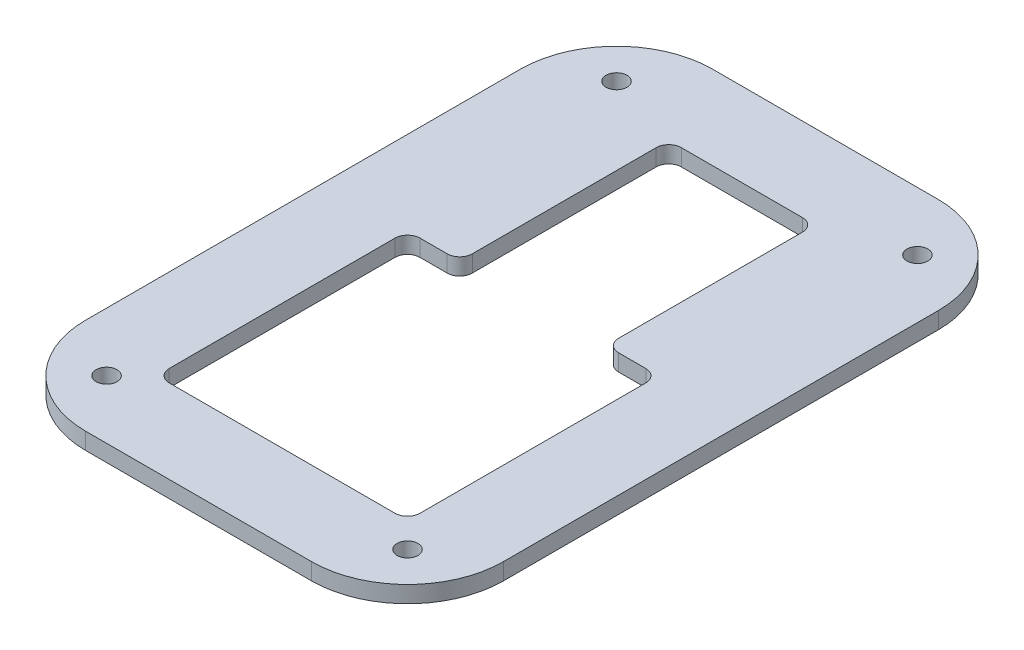
ISO-10303-21;
HEADER;
FILE_DESCRIPTION(('STEP AP214'),'2;1');
FILE_NAME('part.step','',(''),(''),'','','');
FILE_SCHEMA(('AUTOMOTIVE_DESIGN { 1 0 10303 214 1 1 1 1 }'));
ENDSEC;
DATA;
#1=APPLICATION_CONTEXT('core data for automotive mechanical design processes');
#2=APPLICATION_PROTOCOL_DEFINITION('international standard','automotive_design',2000,#1);
#3=PRODUCT_CONTEXT('',#1,'mechanical');
#4=PRODUCT('Part','Part','',(#3));
#5=PRODUCT_RELATED_PRODUCT_CATEGORY('part','',(#4));
#6=PRODUCT_DEFINITION_FORMATION('','',#4);
#7=PRODUCT_DEFINITION_CONTEXT('part definition',#1,'design');
#8=PRODUCT_DEFINITION('design','',#6,#7);
#9=PRODUCT_DEFINITION_SHAPE('','',#8);
#10=(LENGTH_UNIT() NAMED_UNIT(*) SI_UNIT(.MILLI.,.METRE.));
#11=(NAMED_UNIT(*) PLANE_ANGLE_UNIT() SI_UNIT($,.RADIAN.));
#12=(NAMED_UNIT(*) SI_UNIT($,.STERADIAN.) SOLID_ANGLE_UNIT());
#13=UNCERTAINTY_MEASURE_WITH_UNIT(LENGTH_MEASURE(1.E-05),#10,'distance_accuracy_value','');
#14=(GEOMETRIC_REPRESENTATION_CONTEXT(3) GLOBAL_UNCERTAINTY_ASSIGNED_CONTEXT((#13)) GLOBAL_UNIT_ASSIGNED_CONTEXT((#10,
#11,#12)) REPRESENTATION_CONTEXT('',''));
#15=CARTESIAN_POINT('',(0.,0.,0.));
#16=DIRECTION('',(0.,0.,1.));
#17=DIRECTION('',(1.,0.,0.));
#18=AXIS2_PLACEMENT_3D('',#15,#16,#17);
#19=CARTESIAN_POINT('',(-27.,4.,27.));
#20=DIRECTION('',(0.,-1.,0.));
#21=DIRECTION('',(0.,0.,-1.));
#22=AXIS2_PLACEMENT_3D('',#19,#20,#21);
#23=PLANE('',#22);
#24=CARTESIAN_POINT('',(-27.,4.,27.));
#25=DIRECTION('',(0.,1.,0.));
#26=DIRECTION('',(0.,0.,-1.));
#27=AXIS2_PLACEMENT_3D('',#24,#25,#26);
#28=CIRCLE('',#27,23.);
#29=CARTESIAN_POINT('',(-50.,4.,27.));
#30=VERTEX_POINT('',#29);
#31=CARTESIAN_POINT('',(-26.9999999999998,4.,50.));
#32=VERTEX_POINT('',#31);
#33=EDGE_CURVE('E318',#30,#32,#28,.T.);
#34=ORIENTED_EDGE('',*,*,#33,.T.);
#35=DIRECTION('',(1.,0.,0.));
#36=VECTOR('',#35,1.);
#37=CARTESIAN_POINT('',(-26.9999999999998,4.,50.));
#38=LINE('',#37,#36);
#39=CARTESIAN_POINT('',(27.,4.,50.));
#40=VERTEX_POINT('',#39);
#41=EDGE_CURVE('E321',#32,#40,#38,.T.);
#42=ORIENTED_EDGE('',*,*,#41,.T.);
#43=CARTESIAN_POINT('',(27.,4.,27.));
#44=DIRECTION('',(0.,1.,0.));
#45=DIRECTION('',(0.,0.,1.));
#46=AXIS2_PLACEMENT_3D('',#43,#44,#45);
#47=CIRCLE('',#46,23.);
#48=CARTESIAN_POINT('',(50.,4.,26.9999999999998));
#49=VERTEX_POINT('',#48);
#50=EDGE_CURVE('E324',#40,#49,#47,.T.);
#51=ORIENTED_EDGE('',*,*,#50,.T.);
#52=DIRECTION('',(0.,0.,-1.));
#53=VECTOR('',#52,1.);
#54=CARTESIAN_POINT('',(50.,4.,26.9999999999998));
#55=LINE('',#54,#53);
#56=CARTESIAN_POINT('',(50.,4.,-77.));
#57=VERTEX_POINT('',#56);
#58=EDGE_CURVE('E326',#49,#57,#55,.T.);
#59=ORIENTED_EDGE('',*,*,#58,.T.);
#60=CARTESIAN_POINT('',(27.,4.,-77.));
#61=DIRECTION('',(0.,1.,0.));
#62=DIRECTION('',(0.,0.,1.));
#63=AXIS2_PLACEMENT_3D('',#60,#61,#62);
#64=CIRCLE('',#63,23.);
#65=CARTESIAN_POINT('',(27.,4.,-100.));
#66=VERTEX_POINT('',#65);
#67=EDGE_CURVE('E328',#57,#66,#64,.T.);
#68=ORIENTED_EDGE('',*,*,#67,.T.);
#69=DIRECTION('',(-1.,0.,0.));
#70=VECTOR('',#69,1.);
#71=CARTESIAN_POINT('',(-27.,4.,-100.));
#72=LINE('',#71,#70);
#73=CARTESIAN_POINT('',(-27.,4.,-100.));
#74=VERTEX_POINT('',#73);
#75=EDGE_CURVE('E330',#66,#74,#72,.T.);
#76=ORIENTED_EDGE('',*,*,#75,.T.);
#77=CARTESIAN_POINT('',(-27.,4.,-77.));
#78=DIRECTION('',(0.,1.,0.));
#79=DIRECTION('',(0.,0.,-1.));
#80=AXIS2_PLACEMENT_3D('',#77,#78,#79);
#81=CIRCLE('',#80,23.);
#82=CARTESIAN_POINT('',(-50.,4.,-77.));
#83=VERTEX_POINT('',#82);
#84=EDGE_CURVE('E332',#74,#83,#81,.T.);
#85=ORIENTED_EDGE('',*,*,#84,.T.);
#86=DIRECTION('',(0.,0.,1.));
#87=VECTOR('',#86,1.);
#88=CARTESIAN_POINT('',(-50.,4.,27.));
#89=LINE('',#88,#87);
#90=EDGE_CURVE('E334',#83,#30,#89,.T.);
#91=ORIENTED_EDGE('',*,*,#90,.T.);
#92=EDGE_LOOP('',(#34,#42,#51,#59,#68,#76,#85,#91));
#93=FACE_BOUND('',#92,.T.);
#94=CARTESIAN_POINT('',(-27.,4.,27.));
#95=DIRECTION('',(0.,1.,0.));
#96=DIRECTION('',(0.,0.,-1.));
#97=AXIS2_PLACEMENT_3D('',#94,#95,#96);
#98=CIRCLE('',#97,3.);
#99=CARTESIAN_POINT('',(-30.,4.,27.));
#100=VERTEX_POINT('',#99);
#101=CARTESIAN_POINT('',(-27.,4.,30.));
#102=VERTEX_POINT('',#101);
#103=EDGE_CURVE('E194',#100,#102,#98,.T.);
#104=ORIENTED_EDGE('',*,*,#103,.F.);
#105=DIRECTION('',(0.,0.,1.));
#106=VECTOR('',#105,1.);
#107=CARTESIAN_POINT('',(-30.,4.,27.));
#108=LINE('',#107,#106);
#109=CARTESIAN_POINT('',(-30.,4.,-27.));
#110=VERTEX_POINT('',#109);
#111=EDGE_CURVE('E245',#110,#100,#108,.T.);
#112=ORIENTED_EDGE('',*,*,#111,.F.);
#113=CARTESIAN_POINT('',(-27.,4.,-27.));
#114=DIRECTION('',(0.,1.,0.));
#115=DIRECTION('',(0.,0.,-1.));
#116=AXIS2_PLACEMENT_3D('',#113,#114,#115);
#117=CIRCLE('',#116,3.);
#118=CARTESIAN_POINT('',(-27.,4.,-30.));
#119=VERTEX_POINT('',#118);
#120=EDGE_CURVE('E243',#119,#110,#117,.T.);
#121=ORIENTED_EDGE('',*,*,#120,.F.);
#122=DIRECTION('',(-1.,0.,0.));
#123=VECTOR('',#122,1.);
#124=CARTESIAN_POINT('',(-27.,4.,-30.));
#125=LINE('',#124,#123);
#126=CARTESIAN_POINT('',(-20.5,4.,-30.));
#127=VERTEX_POINT('',#126);
#128=EDGE_CURVE('E241',#127,#119,#125,.T.);
#129=ORIENTED_EDGE('',*,*,#128,.F.);
#130=CARTESIAN_POINT('',(-20.5,4.,-33.));
#131=DIRECTION('',(0.,-1.,0.));
#132=DIRECTION('',(0.,0.,-1.));
#133=AXIS2_PLACEMENT_3D('',#130,#131,#132);
#134=CIRCLE('',#133,3.);
#135=CARTESIAN_POINT('',(-17.5,4.,-33.));
#136=VERTEX_POINT('',#135);
#137=EDGE_CURVE('E239',#136,#127,#134,.T.);
#138=ORIENTED_EDGE('',*,*,#137,.F.);
#139=DIRECTION('',(0.,0.,1.));
#140=VECTOR('',#139,1.);
#141=CARTESIAN_POINT('',(-17.5,4.,-33.));
#142=LINE('',#141,#140);
#143=CARTESIAN_POINT('',(-17.5,4.,-77.));
#144=VERTEX_POINT('',#143);
#145=EDGE_CURVE('E237',#144,#136,#142,.T.);
#146=ORIENTED_EDGE('',*,*,#145,.F.);
#147=CARTESIAN_POINT('',(-14.5,4.,-77.));
#148=DIRECTION('',(0.,1.,0.));
#149=DIRECTION('',(0.,0.,-1.));
#150=AXIS2_PLACEMENT_3D('',#147,#148,#149);
#151=CIRCLE('',#150,3.);
#152=CARTESIAN_POINT('',(-14.5,4.,-80.));
#153=VERTEX_POINT('',#152);
#154=EDGE_CURVE('E235',#153,#144,#151,.T.);
#155=ORIENTED_EDGE('',*,*,#154,.F.);
#156=DIRECTION('',(-1.,0.,0.));
#157=VECTOR('',#156,1.);
#158=CARTESIAN_POINT('',(-14.5,4.,-80.));
#159=LINE('',#158,#157);
#160=CARTESIAN_POINT('',(14.5,4.,-80.));
#161=VERTEX_POINT('',#160);
#162=EDGE_CURVE('E233',#161,#153,#159,.T.);
#163=ORIENTED_EDGE('',*,*,#162,.F.);
#164=CARTESIAN_POINT('',(14.5,4.,-77.));
#165=DIRECTION('',(0.,1.,0.));
#166=DIRECTION('',(0.,0.,-1.));
#167=AXIS2_PLACEMENT_3D('',#164,#165,#166);
#168=CIRCLE('',#167,3.);
#169=CARTESIAN_POINT('',(17.5,4.,-77.));
#170=VERTEX_POINT('',#169);
#171=EDGE_CURVE('E231',#170,#161,#168,.T.);
#172=ORIENTED_EDGE('',*,*,#171,.F.);
#173=DIRECTION('',(0.,0.,-1.));
#174=VECTOR('',#173,1.);
#175=CARTESIAN_POINT('',(17.5,4.,-77.));
#176=LINE('',#175,#174);
#177=CARTESIAN_POINT('',(17.5,4.,-33.));
#178=VERTEX_POINT('',#177);
#179=EDGE_CURVE('E229',#178,#170,#176,.T.);
#180=ORIENTED_EDGE('',*,*,#179,.F.);
#181=CARTESIAN_POINT('',(20.5,4.,-33.));
#182=DIRECTION('',(0.,-1.,0.));
#183=DIRECTION('',(0.,0.,1.));
#184=AXIS2_PLACEMENT_3D('',#181,#182,#183);
#185=CIRCLE('',#184,3.);
#186=CARTESIAN_POINT('',(20.5,4.,-30.));
#187=VERTEX_POINT('',#186);
#188=EDGE_CURVE('E227',#187,#178,#185,.T.);
#189=ORIENTED_EDGE('',*,*,#188,.F.);
#190=DIRECTION('',(-1.,0.,0.));
#191=VECTOR('',#190,1.);
#192=CARTESIAN_POINT('',(20.5,4.,-30.));
#193=LINE('',#192,#191);
#194=CARTESIAN_POINT('',(27.,4.,-30.));
#195=VERTEX_POINT('',#194);
#196=EDGE_CURVE('E225',#195,#187,#193,.T.);
#197=ORIENTED_EDGE('',*,*,#196,.F.);
#198=CARTESIAN_POINT('',(27.,4.,-27.));
#199=DIRECTION('',(0.,1.,0.));
#200=DIRECTION('',(0.,0.,-1.));
#201=AXIS2_PLACEMENT_3D('',#198,#199,#200);
#202=CIRCLE('',#201,3.);
#203=CARTESIAN_POINT('',(30.,4.,-27.));
#204=VERTEX_POINT('',#203);
#205=EDGE_CURVE('E223',#204,#195,#202,.T.);
#206=ORIENTED_EDGE('',*,*,#205,.F.);
#207=DIRECTION('',(0.,0.,-1.));
#208=VECTOR('',#207,1.);
#209=CARTESIAN_POINT('',(30.,4.,27.));
#210=LINE('',#209,#208);
#211=CARTESIAN_POINT('',(30.,4.,27.));
#212=VERTEX_POINT('',#211);
#213=EDGE_CURVE('E218',#212,#204,#210,.T.);
#214=ORIENTED_EDGE('',*,*,#213,.F.);
#215=CARTESIAN_POINT('',(27.,4.,27.));
#216=DIRECTION('',(0.,1.,0.));
#217=DIRECTION('',(0.,0.,1.));
#218=AXIS2_PLACEMENT_3D('',#215,#216,#217);
#219=CIRCLE('',#218,3.);
#220=CARTESIAN_POINT('',(27.,4.,30.));
#221=VERTEX_POINT('',#220);
#222=EDGE_CURVE('E216',#221,#212,#219,.T.);
#223=ORIENTED_EDGE('',*,*,#222,.F.);
#224=DIRECTION('',(1.,0.,0.));
#225=VECTOR('',#224,1.);
#226=CARTESIAN_POINT('',(-27.,4.,30.));
#227=LINE('',#226,#225);
#228=EDGE_CURVE('E202',#102,#221,#227,.T.);
#229=ORIENTED_EDGE('',*,*,#228,.F.);
#230=EDGE_LOOP('',(#104,#112,#121,#129,#138,#146,#155,#163,#172,#180,#189,#197,#206,#214,#223,#229));
#231=FACE_BOUND('',#230,.T.);
#232=CARTESIAN_POINT('',(-36.,4.,36.));
#233=DIRECTION('',(0.,1.,0.));
#234=DIRECTION('',(0.,0.,1.));
#235=AXIS2_PLACEMENT_3D('',#232,#233,#234);
#236=CIRCLE('',#235,2.5);
#237=CARTESIAN_POINT('',(-36.,4.,38.5));
#238=VERTEX_POINT('',#237);
#239=EDGE_CURVE('E248',#238,#238,#236,.T.);
#240=ORIENTED_EDGE('',*,*,#239,.F.);
#241=EDGE_LOOP('',(#240));
#242=FACE_BOUND('',#241,.T.);
#243=CARTESIAN_POINT('',(-36.,4.,-86.));
#244=DIRECTION('',(0.,1.,0.));
#245=DIRECTION('',(0.,0.,1.));
#246=AXIS2_PLACEMENT_3D('',#243,#244,#245);
#247=CIRCLE('',#246,2.5);
#248=CARTESIAN_POINT('',(-36.,4.,-83.5));
#249=VERTEX_POINT('',#248);
#250=EDGE_CURVE('E528',#249,#249,#247,.T.);
#251=ORIENTED_EDGE('',*,*,#250,.F.);
#252=EDGE_LOOP('',(#251));
#253=FACE_BOUND('',#252,.T.);
#254=CARTESIAN_POINT('',(36.,4.,36.));
#255=DIRECTION('',(0.,1.,0.));
#256=DIRECTION('',(0.,0.,-1.));
#257=AXIS2_PLACEMENT_3D('',#254,#255,#256);
#258=CIRCLE('',#257,2.5);
#259=CARTESIAN_POINT('',(36.,4.,33.5));
#260=VERTEX_POINT('',#259);
#261=EDGE_CURVE('E522',#260,#260,#258,.T.);
#262=ORIENTED_EDGE('',*,*,#261,.F.);
#263=EDGE_LOOP('',(#262));
#264=FACE_BOUND('',#263,.T.);
#265=CARTESIAN_POINT('',(36.,4.,-86.));
#266=DIRECTION('',(0.,1.,0.));
#267=DIRECTION('',(0.,0.,-1.));
#268=AXIS2_PLACEMENT_3D('',#265,#266,#267);
#269=CIRCLE('',#268,2.5);
#270=CARTESIAN_POINT('',(36.,4.,-88.5));
#271=VERTEX_POINT('',#270);
#272=EDGE_CURVE('E513',#271,#271,#269,.T.);
#273=ORIENTED_EDGE('',*,*,#272,.F.);
#274=EDGE_LOOP('',(#273));
#275=FACE_BOUND('',#274,.T.);
#276=ADVANCED_FACE('F33',(#93,#231,#242,#253,#264,#275),#23,.F.);
#277=CARTESIAN_POINT('',(-27.,0.,27.));
#278=DIRECTION('',(0.,-1.,0.));
#279=DIRECTION('',(0.,0.,-1.));
#280=AXIS2_PLACEMENT_3D('',#277,#278,#279);
#281=PLANE('',#280);
#282=CARTESIAN_POINT('',(36.,0.,36.));
#283=DIRECTION('',(0.,1.,0.));
#284=DIRECTION('',(0.,0.,-1.));
#285=AXIS2_PLACEMENT_3D('',#282,#283,#284);
#286=CIRCLE('',#285,2.5);
#287=CARTESIAN_POINT('',(36.,0.,33.5));
#288=VERTEX_POINT('',#287);
#289=EDGE_CURVE('E519',#288,#288,#286,.T.);
#290=ORIENTED_EDGE('',*,*,#289,.T.);
#291=EDGE_LOOP('',(#290));
#292=FACE_BOUND('',#291,.T.);
#293=CARTESIAN_POINT('',(-36.,0.,36.));
#294=DIRECTION('',(0.,1.,0.));
#295=DIRECTION('',(0.,0.,1.));
#296=AXIS2_PLACEMENT_3D('',#293,#294,#295);
#297=CIRCLE('',#296,2.5);
#298=CARTESIAN_POINT('',(-36.,0.,38.5));
#299=VERTEX_POINT('',#298);
#300=EDGE_CURVE('E531',#299,#299,#297,.T.);
#301=ORIENTED_EDGE('',*,*,#300,.T.);
#302=EDGE_LOOP('',(#301));
#303=FACE_BOUND('',#302,.T.);
#304=CARTESIAN_POINT('',(-27.,0.,27.));
#305=DIRECTION('',(0.,1.,0.));
#306=DIRECTION('',(0.,0.,-1.));
#307=AXIS2_PLACEMENT_3D('',#304,#305,#306);
#308=CIRCLE('',#307,23.);
#309=CARTESIAN_POINT('',(-50.,0.,27.));
#310=VERTEX_POINT('',#309);
#311=CARTESIAN_POINT('',(-26.9999999999998,0.,50.));
#312=VERTEX_POINT('',#311);
#313=EDGE_CURVE('E210',#310,#312,#308,.T.);
#314=ORIENTED_EDGE('',*,*,#313,.F.);
#315=DIRECTION('',(0.,0.,1.));
#316=VECTOR('',#315,1.);
#317=CARTESIAN_POINT('',(-50.,0.,27.));
#318=LINE('',#317,#316);
#319=CARTESIAN_POINT('',(-50.,0.,-77.));
#320=VERTEX_POINT('',#319);
#321=EDGE_CURVE('E322',#320,#310,#318,.T.);
#322=ORIENTED_EDGE('',*,*,#321,.F.);
#323=CARTESIAN_POINT('',(-27.,0.,-77.));
#324=DIRECTION('',(0.,1.,0.));
#325=DIRECTION('',(0.,0.,-1.));
#326=AXIS2_PLACEMENT_3D('',#323,#324,#325);
#327=CIRCLE('',#326,23.);
#328=CARTESIAN_POINT('',(-27.,0.,-100.));
#329=VERTEX_POINT('',#328);
#330=EDGE_CURVE('E349',#329,#320,#327,.T.);
#331=ORIENTED_EDGE('',*,*,#330,.F.);
#332=DIRECTION('',(-1.,0.,0.));
#333=VECTOR('',#332,1.);
#334=CARTESIAN_POINT('',(-27.,0.,-100.));
#335=LINE('',#334,#333);
#336=CARTESIAN_POINT('',(27.,0.,-100.));
#337=VERTEX_POINT('',#336);
#338=EDGE_CURVE('E347',#337,#329,#335,.T.);
#339=ORIENTED_EDGE('',*,*,#338,.F.);
#340=CARTESIAN_POINT('',(27.,0.,-77.));
#341=DIRECTION('',(0.,1.,0.));
#342=DIRECTION('',(0.,0.,1.));
#343=AXIS2_PLACEMENT_3D('',#340,#341,#342);
#344=CIRCLE('',#343,23.);
#345=CARTESIAN_POINT('',(50.,0.,-77.));
#346=VERTEX_POINT('',#345);
#347=EDGE_CURVE('E345',#346,#337,#344,.T.);
#348=ORIENTED_EDGE('',*,*,#347,.F.);
#349=DIRECTION('',(0.,0.,-1.));
#350=VECTOR('',#349,1.);
#351=CARTESIAN_POINT('',(50.,0.,26.9999999999998));
#352=LINE('',#351,#350);
#353=CARTESIAN_POINT('',(50.,0.,26.9999999999998));
#354=VERTEX_POINT('',#353);
#355=EDGE_CURVE('E343',#354,#346,#352,.T.);
#356=ORIENTED_EDGE('',*,*,#355,.F.);
#357=CARTESIAN_POINT('',(27.,0.,27.));
#358=DIRECTION('',(0.,1.,0.));
#359=DIRECTION('',(0.,0.,1.));
#360=AXIS2_PLACEMENT_3D('',#357,#358,#359);
#361=CIRCLE('',#360,23.);
#362=CARTESIAN_POINT('',(27.,0.,50.));
#363=VERTEX_POINT('',#362);
#364=EDGE_CURVE('E341',#363,#354,#361,.T.);
#365=ORIENTED_EDGE('',*,*,#364,.F.);
#366=DIRECTION('',(1.,0.,0.));
#367=VECTOR('',#366,1.);
#368=CARTESIAN_POINT('',(-26.9999999999998,0.,50.));
#369=LINE('',#368,#367);
#370=EDGE_CURVE('E339',#312,#363,#369,.T.);
#371=ORIENTED_EDGE('',*,*,#370,.F.);
#372=EDGE_LOOP('',(#314,#322,#331,#339,#348,#356,#365,#371));
#373=FACE_BOUND('',#372,.T.);
#374=DIRECTION('',(0.,0.,1.));
#375=VECTOR('',#374,1.);
#376=CARTESIAN_POINT('',(-30.,0.,27.));
#377=LINE('',#376,#375);
#378=CARTESIAN_POINT('',(-30.,0.,-27.));
#379=VERTEX_POINT('',#378);
#380=CARTESIAN_POINT('',(-30.,0.,27.));
#381=VERTEX_POINT('',#380);
#382=EDGE_CURVE('E203',#379,#381,#377,.T.);
#383=ORIENTED_EDGE('',*,*,#382,.T.);
#384=CARTESIAN_POINT('',(-27.,0.,27.));
#385=DIRECTION('',(0.,1.,0.));
#386=DIRECTION('',(0.,0.,-1.));
#387=AXIS2_PLACEMENT_3D('',#384,#385,#386);
#388=CIRCLE('',#387,3.);
#389=CARTESIAN_POINT('',(-27.,0.,30.));
#390=VERTEX_POINT('',#389);
#391=EDGE_CURVE('E56',#381,#390,#388,.T.);
#392=ORIENTED_EDGE('',*,*,#391,.T.);
#393=DIRECTION('',(1.,0.,0.));
#394=VECTOR('',#393,1.);
#395=CARTESIAN_POINT('',(-27.,0.,30.));
#396=LINE('',#395,#394);
#397=CARTESIAN_POINT('',(27.,0.,30.));
#398=VERTEX_POINT('',#397);
#399=EDGE_CURVE('E209',#390,#398,#396,.T.);
#400=ORIENTED_EDGE('',*,*,#399,.T.);
#401=CARTESIAN_POINT('',(27.,0.,27.));
#402=DIRECTION('',(0.,1.,0.));
#403=DIRECTION('',(0.,0.,1.));
#404=AXIS2_PLACEMENT_3D('',#401,#402,#403);
#405=CIRCLE('',#404,3.);
#406=CARTESIAN_POINT('',(30.,0.,27.));
#407=VERTEX_POINT('',#406);
#408=EDGE_CURVE('E250',#398,#407,#405,.T.);
#409=ORIENTED_EDGE('',*,*,#408,.T.);
#410=DIRECTION('',(0.,0.,-1.));
#411=VECTOR('',#410,1.);
#412=CARTESIAN_POINT('',(30.,0.,27.));
#413=LINE('',#412,#411);
#414=CARTESIAN_POINT('',(30.,0.,-27.));
#415=VERTEX_POINT('',#414);
#416=EDGE_CURVE('E253',#407,#415,#413,.T.);
#417=ORIENTED_EDGE('',*,*,#416,.T.);
#418=CARTESIAN_POINT('',(27.,0.,-27.));
#419=DIRECTION('',(0.,1.,0.));
#420=DIRECTION('',(0.,0.,-1.));
#421=AXIS2_PLACEMENT_3D('',#418,#419,#420);
#422=CIRCLE('',#421,3.);
#423=CARTESIAN_POINT('',(27.,0.,-30.));
#424=VERTEX_POINT('',#423);
#425=EDGE_CURVE('E256',#415,#424,#422,.T.);
#426=ORIENTED_EDGE('',*,*,#425,.T.);
#427=DIRECTION('',(-1.,0.,0.));
#428=VECTOR('',#427,1.);
#429=CARTESIAN_POINT('',(20.5,0.,-30.));
#430=LINE('',#429,#428);
#431=CARTESIAN_POINT('',(20.5,0.,-30.));
#432=VERTEX_POINT('',#431);
#433=EDGE_CURVE('E259',#424,#432,#430,.T.);
#434=ORIENTED_EDGE('',*,*,#433,.T.);
#435=CARTESIAN_POINT('',(20.5,0.,-33.));
#436=DIRECTION('',(0.,-1.,0.));
#437=DIRECTION('',(0.,0.,1.));
#438=AXIS2_PLACEMENT_3D('',#435,#436,#437);
#439=CIRCLE('',#438,3.);
#440=CARTESIAN_POINT('',(17.5,0.,-33.));
#441=VERTEX_POINT('',#440);
#442=EDGE_CURVE('E262',#432,#441,#439,.T.);
#443=ORIENTED_EDGE('',*,*,#442,.T.);
#444=DIRECTION('',(0.,0.,-1.));
#445=VECTOR('',#444,1.);
#446=CARTESIAN_POINT('',(17.5,0.,-77.));
#447=LINE('',#446,#445);
#448=CARTESIAN_POINT('',(17.5,0.,-77.));
#449=VERTEX_POINT('',#448);
#450=EDGE_CURVE('E265',#441,#449,#447,.T.);
#451=ORIENTED_EDGE('',*,*,#450,.T.);
#452=CARTESIAN_POINT('',(14.5,0.,-77.));
#453=DIRECTION('',(0.,1.,0.));
#454=DIRECTION('',(0.,0.,-1.));
#455=AXIS2_PLACEMENT_3D('',#452,#453,#454);
#456=CIRCLE('',#455,3.);
#457=CARTESIAN_POINT('',(14.5,0.,-80.));
#458=VERTEX_POINT('',#457);
#459=EDGE_CURVE('E268',#449,#458,#456,.T.);
#460=ORIENTED_EDGE('',*,*,#459,.T.);
#461=DIRECTION('',(-1.,0.,0.));
#462=VECTOR('',#461,1.);
#463=CARTESIAN_POINT('',(-14.5,0.,-80.));
#464=LINE('',#463,#462);
#465=CARTESIAN_POINT('',(-14.5,0.,-80.));
#466=VERTEX_POINT('',#465);
#467=EDGE_CURVE('E271',#458,#466,#464,.T.);
#468=ORIENTED_EDGE('',*,*,#467,.T.);
#469=CARTESIAN_POINT('',(-14.5,0.,-77.));
#470=DIRECTION('',(0.,1.,0.));
#471=DIRECTION('',(0.,0.,-1.));
#472=AXIS2_PLACEMENT_3D('',#469,#470,#471);
#473=CIRCLE('',#472,3.);
#474=CARTESIAN_POINT('',(-17.5,0.,-77.));
#475=VERTEX_POINT('',#474);
#476=EDGE_CURVE('E274',#466,#475,#473,.T.);
#477=ORIENTED_EDGE('',*,*,#476,.T.);
#478=DIRECTION('',(0.,0.,1.));
#479=VECTOR('',#478,1.);
#480=CARTESIAN_POINT('',(-17.5,0.,-33.));
#481=LINE('',#480,#479);
#482=CARTESIAN_POINT('',(-17.5,0.,-33.));
#483=VERTEX_POINT('',#482);
#484=EDGE_CURVE('E277',#475,#483,#481,.T.);
#485=ORIENTED_EDGE('',*,*,#484,.T.);
#486=CARTESIAN_POINT('',(-20.5,0.,-33.));
#487=DIRECTION('',(0.,-1.,0.));
#488=DIRECTION('',(0.,0.,-1.));
#489=AXIS2_PLACEMENT_3D('',#486,#487,#488);
#490=CIRCLE('',#489,3.);
#491=CARTESIAN_POINT('',(-20.5,0.,-30.));
#492=VERTEX_POINT('',#491);
#493=EDGE_CURVE('E280',#483,#492,#490,.T.);
#494=ORIENTED_EDGE('',*,*,#493,.T.);
#495=DIRECTION('',(-1.,0.,0.));
#496=VECTOR('',#495,1.);
#497=CARTESIAN_POINT('',(-27.,0.,-30.));
#498=LINE('',#497,#496);
#499=CARTESIAN_POINT('',(-27.,0.,-30.));
#500=VERTEX_POINT('',#499);
#501=EDGE_CURVE('E283',#492,#500,#498,.T.);
#502=ORIENTED_EDGE('',*,*,#501,.T.);
#503=CARTESIAN_POINT('',(-27.,0.,-27.));
#504=DIRECTION('',(0.,1.,0.));
#505=DIRECTION('',(0.,0.,-1.));
#506=AXIS2_PLACEMENT_3D('',#503,#504,#505);
#507=CIRCLE('',#506,3.);
#508=EDGE_CURVE('E286',#500,#379,#507,.T.);
#509=ORIENTED_EDGE('',*,*,#508,.T.);
#510=EDGE_LOOP('',(#383,#392,#400,#409,#417,#426,#434,#443,#451,#460,#468,#477,#485,#494,#502,#509));
#511=FACE_BOUND('',#510,.T.);
#512=CARTESIAN_POINT('',(-36.,0.,-86.));
#513=DIRECTION('',(0.,1.,0.));
#514=DIRECTION('',(0.,0.,1.));
#515=AXIS2_PLACEMENT_3D('',#512,#513,#514);
#516=CIRCLE('',#515,2.5);
#517=CARTESIAN_POINT('',(-36.,0.,-83.5));
#518=VERTEX_POINT('',#517);
#519=EDGE_CURVE('E525',#518,#518,#516,.T.);
#520=ORIENTED_EDGE('',*,*,#519,.T.);
#521=EDGE_LOOP('',(#520));
#522=FACE_BOUND('',#521,.T.);
#523=CARTESIAN_POINT('',(36.,0.,-86.));
#524=DIRECTION('',(0.,1.,0.));
#525=DIRECTION('',(0.,0.,-1.));
#526=AXIS2_PLACEMENT_3D('',#523,#524,#525);
#527=CIRCLE('',#526,2.5);
#528=CARTESIAN_POINT('',(36.,0.,-88.5));
#529=VERTEX_POINT('',#528);
#530=EDGE_CURVE('E516',#529,#529,#527,.T.);
#531=ORIENTED_EDGE('',*,*,#530,.T.);
#532=EDGE_LOOP('',(#531));
#533=FACE_BOUND('',#532,.T.);
#534=ADVANCED_FACE('F379',(#292,#303,#373,#511,#522,#533),#281,.T.);
#535=CARTESIAN_POINT('',(-27.,4.,27.));
#536=DIRECTION('',(0.,-1.,0.));
#537=DIRECTION('',(0.,0.,-1.));
#538=AXIS2_PLACEMENT_3D('',#535,#536,#537);
#539=CYLINDRICAL_SURFACE('',#538,23.);
#540=ORIENTED_EDGE('',*,*,#313,.T.);
#541=DIRECTION('',(0.,-1.,0.));
#542=VECTOR('',#541,1.);
#543=CARTESIAN_POINT('',(-26.9999999999998,4.,50.));
#544=LINE('',#543,#542);
#545=EDGE_CURVE('E11',#32,#312,#544,.T.);
#546=ORIENTED_EDGE('',*,*,#545,.F.);
#547=ORIENTED_EDGE('',*,*,#33,.F.);
#548=DIRECTION('',(0.,-1.,0.));
#549=VECTOR('',#548,1.);
#550=CARTESIAN_POINT('',(-50.,4.,27.));
#551=LINE('',#550,#549);
#552=EDGE_CURVE('E336',#30,#310,#551,.T.);
#553=ORIENTED_EDGE('',*,*,#552,.T.);
#554=EDGE_LOOP('',(#540,#546,#547,#553));
#555=FACE_BOUND('',#554,.T.);
#556=ADVANCED_FACE('F35',(#555),#539,.T.);
#557=CARTESIAN_POINT('',(-26.9999999999998,4.,50.));
#558=DIRECTION('',(0.,0.,-1.));
#559=DIRECTION('',(-1.,0.,0.));
#560=AXIS2_PLACEMENT_3D('',#557,#558,#559);
#561=PLANE('',#560);
#562=ORIENTED_EDGE('',*,*,#370,.T.);
#563=DIRECTION('',(0.,-1.,0.));
#564=VECTOR('',#563,1.);
#565=CARTESIAN_POINT('',(27.,4.,50.));
#566=LINE('',#565,#564);
#567=EDGE_CURVE('E41',#40,#363,#566,.T.);
#568=ORIENTED_EDGE('',*,*,#567,.F.);
#569=ORIENTED_EDGE('',*,*,#41,.F.);
#570=ORIENTED_EDGE('',*,*,#545,.T.);
#571=EDGE_LOOP('',(#562,#568,#569,#570));
#572=FACE_BOUND('',#571,.T.);
#573=ADVANCED_FACE('F396',(#572),#561,.F.);
#574=CARTESIAN_POINT('',(27.,4.,27.));
#575=DIRECTION('',(0.,-1.,0.));
#576=DIRECTION('',(0.,0.,-1.));
#577=AXIS2_PLACEMENT_3D('',#574,#575,#576);
#578=CYLINDRICAL_SURFACE('',#577,23.);
#579=ORIENTED_EDGE('',*,*,#364,.T.);
#580=DIRECTION('',(0.,-1.,0.));
#581=VECTOR('',#580,1.);
#582=CARTESIAN_POINT('',(50.,4.,26.9999999999998));
#583=LINE('',#582,#581);
#584=EDGE_CURVE('E366',#49,#354,#583,.T.);
#585=ORIENTED_EDGE('',*,*,#584,.F.);
#586=ORIENTED_EDGE('',*,*,#50,.F.);
#587=ORIENTED_EDGE('',*,*,#567,.T.);
#588=EDGE_LOOP('',(#579,#585,#586,#587));
#589=FACE_BOUND('',#588,.T.);
#590=ADVANCED_FACE('F373',(#589),#578,.T.);
#591=CARTESIAN_POINT('',(50.,4.,26.9999999999998));
#592=DIRECTION('',(-1.,0.,0.));
#593=DIRECTION('',(0.,0.,1.));
#594=AXIS2_PLACEMENT_3D('',#591,#592,#593);
#595=PLANE('',#594);
#596=ORIENTED_EDGE('',*,*,#355,.T.);
#597=DIRECTION('',(0.,-1.,0.));
#598=VECTOR('',#597,1.);
#599=CARTESIAN_POINT('',(50.,4.,-77.));
#600=LINE('',#599,#598);
#601=EDGE_CURVE('E363',#57,#346,#600,.T.);
#602=ORIENTED_EDGE('',*,*,#601,.F.);
#603=ORIENTED_EDGE('',*,*,#58,.F.);
#604=ORIENTED_EDGE('',*,*,#584,.T.);
#605=EDGE_LOOP('',(#596,#602,#603,#604));
#606=FACE_BOUND('',#605,.T.);
#607=ADVANCED_FACE('F385',(#606),#595,.F.);
#608=CARTESIAN_POINT('',(27.,4.,-77.));
#609=DIRECTION('',(0.,-1.,0.));
#610=DIRECTION('',(0.,0.,-1.));
#611=AXIS2_PLACEMENT_3D('',#608,#609,#610);
#612=CYLINDRICAL_SURFACE('',#611,23.);
#613=ORIENTED_EDGE('',*,*,#347,.T.);
#614=DIRECTION('',(0.,-1.,0.));
#615=VECTOR('',#614,1.);
#616=CARTESIAN_POINT('',(27.,4.,-100.));
#617=LINE('',#616,#615);
#618=EDGE_CURVE('E360',#66,#337,#617,.T.);
#619=ORIENTED_EDGE('',*,*,#618,.F.);
#620=ORIENTED_EDGE('',*,*,#67,.F.);
#621=ORIENTED_EDGE('',*,*,#601,.T.);
#622=EDGE_LOOP('',(#613,#619,#620,#621));
#623=FACE_BOUND('',#622,.T.);
#624=ADVANCED_FACE('F389',(#623),#612,.T.);
#625=CARTESIAN_POINT('',(-27.,4.,-100.));
#626=DIRECTION('',(0.,0.,1.));
#627=DIRECTION('',(1.,0.,0.));
#628=AXIS2_PLACEMENT_3D('',#625,#626,#627);
#629=PLANE('',#628);
#630=ORIENTED_EDGE('',*,*,#338,.T.);
#631=DIRECTION('',(0.,-1.,0.));
#632=VECTOR('',#631,1.);
#633=CARTESIAN_POINT('',(-27.,4.,-100.));
#634=LINE('',#633,#632);
#635=EDGE_CURVE('E357',#74,#329,#634,.T.);
#636=ORIENTED_EDGE('',*,*,#635,.F.);
#637=ORIENTED_EDGE('',*,*,#75,.F.);
#638=ORIENTED_EDGE('',*,*,#618,.T.);
#639=EDGE_LOOP('',(#630,#636,#637,#638));
#640=FACE_BOUND('',#639,.T.);
#641=ADVANCED_FACE('F409',(#640),#629,.F.);
#642=CARTESIAN_POINT('',(-27.,4.,-77.));
#643=DIRECTION('',(0.,-1.,0.));
#644=DIRECTION('',(0.,0.,-1.));
#645=AXIS2_PLACEMENT_3D('',#642,#643,#644);
#646=CYLINDRICAL_SURFACE('',#645,23.);
#647=ORIENTED_EDGE('',*,*,#330,.T.);
#648=DIRECTION('',(0.,-1.,0.));
#649=VECTOR('',#648,1.);
#650=CARTESIAN_POINT('',(-50.,4.,-77.));
#651=LINE('',#650,#649);
#652=EDGE_CURVE('E354',#83,#320,#651,.T.);
#653=ORIENTED_EDGE('',*,*,#652,.F.);
#654=ORIENTED_EDGE('',*,*,#84,.F.);
#655=ORIENTED_EDGE('',*,*,#635,.T.);
#656=EDGE_LOOP('',(#647,#653,#654,#655));
#657=FACE_BOUND('',#656,.T.);
#658=ADVANCED_FACE('F407',(#657),#646,.T.);
#659=CARTESIAN_POINT('',(-50.,4.,27.));
#660=DIRECTION('',(1.,0.,0.));
#661=DIRECTION('',(0.,0.,-1.));
#662=AXIS2_PLACEMENT_3D('',#659,#660,#661);
#663=PLANE('',#662);
#664=ORIENTED_EDGE('',*,*,#321,.T.);
#665=ORIENTED_EDGE('',*,*,#552,.F.);
#666=ORIENTED_EDGE('',*,*,#90,.F.);
#667=ORIENTED_EDGE('',*,*,#652,.T.);
#668=EDGE_LOOP('',(#664,#665,#666,#667));
#669=FACE_BOUND('',#668,.T.);
#670=ADVANCED_FACE('F402',(#669),#663,.F.);
#671=CARTESIAN_POINT('',(-27.,4.,27.));
#672=DIRECTION('',(0.,-1.,0.));
#673=DIRECTION('',(0.,0.,-1.));
#674=AXIS2_PLACEMENT_3D('',#671,#672,#673);
#675=CYLINDRICAL_SURFACE('',#674,3.);
#676=ORIENTED_EDGE('',*,*,#391,.F.);
#677=DIRECTION('',(0.,-1.,0.));
#678=VECTOR('',#677,1.);
#679=CARTESIAN_POINT('',(-30.,4.,27.));
#680=LINE('',#679,#678);
#681=EDGE_CURVE('E198',#100,#381,#680,.T.);
#682=ORIENTED_EDGE('',*,*,#681,.F.);
#683=ORIENTED_EDGE('',*,*,#103,.T.);
#684=DIRECTION('',(0.,-1.,0.));
#685=VECTOR('',#684,1.);
#686=CARTESIAN_POINT('',(-27.,4.,30.));
#687=LINE('',#686,#685);
#688=EDGE_CURVE('E197',#102,#390,#687,.T.);
#689=ORIENTED_EDGE('',*,*,#688,.T.);
#690=EDGE_LOOP('',(#676,#682,#683,#689));
#691=FACE_BOUND('',#690,.T.);
#692=ADVANCED_FACE('F196',(#691),#675,.F.);
#693=CARTESIAN_POINT('',(-27.,4.,30.));
#694=DIRECTION('',(0.,0.,-1.));
#695=DIRECTION('',(-1.,0.,0.));
#696=AXIS2_PLACEMENT_3D('',#693,#694,#695);
#697=PLANE('',#696);
#698=ORIENTED_EDGE('',*,*,#399,.F.);
#699=ORIENTED_EDGE('',*,*,#688,.F.);
#700=ORIENTED_EDGE('',*,*,#228,.T.);
#701=DIRECTION('',(0.,-1.,0.));
#702=VECTOR('',#701,1.);
#703=CARTESIAN_POINT('',(27.,4.,30.));
#704=LINE('',#703,#702);
#705=EDGE_CURVE('E211',#221,#398,#704,.T.);
#706=ORIENTED_EDGE('',*,*,#705,.T.);
#707=EDGE_LOOP('',(#698,#699,#700,#706));
#708=FACE_BOUND('',#707,.T.);
#709=ADVANCED_FACE('F206',(#708),#697,.T.);
#710=CARTESIAN_POINT('',(27.,4.,27.));
#711=DIRECTION('',(0.,-1.,0.));
#712=DIRECTION('',(0.,0.,-1.));
#713=AXIS2_PLACEMENT_3D('',#710,#711,#712);
#714=CYLINDRICAL_SURFACE('',#713,3.);
#715=ORIENTED_EDGE('',*,*,#408,.F.);
#716=ORIENTED_EDGE('',*,*,#705,.F.);
#717=ORIENTED_EDGE('',*,*,#222,.T.);
#718=DIRECTION('',(0.,-1.,0.));
#719=VECTOR('',#718,1.);
#720=CARTESIAN_POINT('',(30.,4.,27.));
#721=LINE('',#720,#719);
#722=EDGE_CURVE('E315',#212,#407,#721,.T.);
#723=ORIENTED_EDGE('',*,*,#722,.T.);
#724=EDGE_LOOP('',(#715,#716,#717,#723));
#725=FACE_BOUND('',#724,.T.);
#726=ADVANCED_FACE('F435',(#725),#714,.F.);
#727=CARTESIAN_POINT('',(30.,4.,27.));
#728=DIRECTION('',(-1.,0.,0.));
#729=DIRECTION('',(0.,0.,1.));
#730=AXIS2_PLACEMENT_3D('',#727,#728,#729);
#731=PLANE('',#730);
#732=ORIENTED_EDGE('',*,*,#416,.F.);
#733=ORIENTED_EDGE('',*,*,#722,.F.);
#734=ORIENTED_EDGE('',*,*,#213,.T.);
#735=DIRECTION('',(0.,-1.,0.));
#736=VECTOR('',#735,1.);
#737=CARTESIAN_POINT('',(30.,4.,-27.));
#738=LINE('',#737,#736);
#739=EDGE_CURVE('E313',#204,#415,#738,.T.);
#740=ORIENTED_EDGE('',*,*,#739,.T.);
#741=EDGE_LOOP('',(#732,#733,#734,#740));
#742=FACE_BOUND('',#741,.T.);
#743=ADVANCED_FACE('F439',(#742),#731,.T.);
#744=CARTESIAN_POINT('',(27.,4.,-27.));
#745=DIRECTION('',(0.,-1.,0.));
#746=DIRECTION('',(0.,0.,-1.));
#747=AXIS2_PLACEMENT_3D('',#744,#745,#746);
#748=CYLINDRICAL_SURFACE('',#747,3.);
#749=ORIENTED_EDGE('',*,*,#425,.F.);
#750=ORIENTED_EDGE('',*,*,#739,.F.);
#751=ORIENTED_EDGE('',*,*,#205,.T.);
#752=DIRECTION('',(0.,-1.,0.));
#753=VECTOR('',#752,1.);
#754=CARTESIAN_POINT('',(27.,4.,-30.));
#755=LINE('',#754,#753);
#756=EDGE_CURVE('E311',#195,#424,#755,.T.);
#757=ORIENTED_EDGE('',*,*,#756,.T.);
#758=EDGE_LOOP('',(#749,#750,#751,#757));
#759=FACE_BOUND('',#758,.T.);
#760=ADVANCED_FACE('F445',(#759),#748,.F.);
#761=CARTESIAN_POINT('',(20.5,4.,-30.));
#762=DIRECTION('',(0.,0.,1.));
#763=DIRECTION('',(1.,0.,0.));
#764=AXIS2_PLACEMENT_3D('',#761,#762,#763);
#765=PLANE('',#764);
#766=ORIENTED_EDGE('',*,*,#433,.F.);
#767=ORIENTED_EDGE('',*,*,#756,.F.);
#768=ORIENTED_EDGE('',*,*,#196,.T.);
#769=DIRECTION('',(0.,-1.,0.));
#770=VECTOR('',#769,1.);
#771=CARTESIAN_POINT('',(20.5,4.,-30.));
#772=LINE('',#771,#770);
#773=EDGE_CURVE('E309',#187,#432,#772,.T.);
#774=ORIENTED_EDGE('',*,*,#773,.T.);
#775=EDGE_LOOP('',(#766,#767,#768,#774));
#776=FACE_BOUND('',#775,.T.);
#777=ADVANCED_FACE('F449',(#776),#765,.T.);
#778=CARTESIAN_POINT('',(20.5,4.,-33.));
#779=DIRECTION('',(0.,-1.,0.));
#780=DIRECTION('',(0.,0.,-1.));
#781=AXIS2_PLACEMENT_3D('',#778,#779,#780);
#782=CYLINDRICAL_SURFACE('',#781,3.);
#783=ORIENTED_EDGE('',*,*,#442,.F.);
#784=ORIENTED_EDGE('',*,*,#773,.F.);
#785=ORIENTED_EDGE('',*,*,#188,.T.);
#786=DIRECTION('',(0.,-1.,0.));
#787=VECTOR('',#786,1.);
#788=CARTESIAN_POINT('',(17.5,4.,-33.));
#789=LINE('',#788,#787);
#790=EDGE_CURVE('E307',#178,#441,#789,.T.);
#791=ORIENTED_EDGE('',*,*,#790,.T.);
#792=EDGE_LOOP('',(#783,#784,#785,#791));
#793=FACE_BOUND('',#792,.T.);
#794=ADVANCED_FACE('F453',(#793),#782,.T.);
#795=CARTESIAN_POINT('',(17.5,4.,-77.));
#796=DIRECTION('',(-1.,0.,0.));
#797=DIRECTION('',(0.,0.,1.));
#798=AXIS2_PLACEMENT_3D('',#795,#796,#797);
#799=PLANE('',#798);
#800=ORIENTED_EDGE('',*,*,#450,.F.);
#801=ORIENTED_EDGE('',*,*,#790,.F.);
#802=ORIENTED_EDGE('',*,*,#179,.T.);
#803=DIRECTION('',(0.,-1.,0.));
#804=VECTOR('',#803,1.);
#805=CARTESIAN_POINT('',(17.5,4.,-77.));
#806=LINE('',#805,#804);
#807=EDGE_CURVE('E305',#170,#449,#806,.T.);
#808=ORIENTED_EDGE('',*,*,#807,.T.);
#809=EDGE_LOOP('',(#800,#801,#802,#808));
#810=FACE_BOUND('',#809,.T.);
#811=ADVANCED_FACE('F457',(#810),#799,.T.);
#812=CARTESIAN_POINT('',(14.5,4.,-77.));
#813=DIRECTION('',(0.,-1.,0.));
#814=DIRECTION('',(0.,0.,-1.));
#815=AXIS2_PLACEMENT_3D('',#812,#813,#814);
#816=CYLINDRICAL_SURFACE('',#815,3.);
#817=ORIENTED_EDGE('',*,*,#459,.F.);
#818=ORIENTED_EDGE('',*,*,#807,.F.);
#819=ORIENTED_EDGE('',*,*,#171,.T.);
#820=DIRECTION('',(0.,-1.,0.));
#821=VECTOR('',#820,1.);
#822=CARTESIAN_POINT('',(14.5,4.,-80.));
#823=LINE('',#822,#821);
#824=EDGE_CURVE('E303',#161,#458,#823,.T.);
#825=ORIENTED_EDGE('',*,*,#824,.T.);
#826=EDGE_LOOP('',(#817,#818,#819,#825));
#827=FACE_BOUND('',#826,.T.);
#828=ADVANCED_FACE('F461',(#827),#816,.F.);
#829=CARTESIAN_POINT('',(-14.5,4.,-80.));
#830=DIRECTION('',(0.,0.,1.));
#831=DIRECTION('',(1.,0.,0.));
#832=AXIS2_PLACEMENT_3D('',#829,#830,#831);
#833=PLANE('',#832);
#834=ORIENTED_EDGE('',*,*,#467,.F.);
#835=ORIENTED_EDGE('',*,*,#824,.F.);
#836=ORIENTED_EDGE('',*,*,#162,.T.);
#837=DIRECTION('',(0.,-1.,0.));
#838=VECTOR('',#837,1.);
#839=CARTESIAN_POINT('',(-14.5,4.,-80.));
#840=LINE('',#839,#838);
#841=EDGE_CURVE('E301',#153,#466,#840,.T.);
#842=ORIENTED_EDGE('',*,*,#841,.T.);
#843=EDGE_LOOP('',(#834,#835,#836,#842));
#844=FACE_BOUND('',#843,.T.);
#845=ADVANCED_FACE('F465',(#844),#833,.T.);
#846=CARTESIAN_POINT('',(-14.5,4.,-77.));
#847=DIRECTION('',(0.,-1.,0.));
#848=DIRECTION('',(0.,0.,-1.));
#849=AXIS2_PLACEMENT_3D('',#846,#847,#848);
#850=CYLINDRICAL_SURFACE('',#849,3.);
#851=ORIENTED_EDGE('',*,*,#476,.F.);
#852=ORIENTED_EDGE('',*,*,#841,.F.);
#853=ORIENTED_EDGE('',*,*,#154,.T.);
#854=DIRECTION('',(0.,-1.,0.));
#855=VECTOR('',#854,1.);
#856=CARTESIAN_POINT('',(-17.5,4.,-77.));
#857=LINE('',#856,#855);
#858=EDGE_CURVE('E299',#144,#475,#857,.T.);
#859=ORIENTED_EDGE('',*,*,#858,.T.);
#860=EDGE_LOOP('',(#851,#852,#853,#859));
#861=FACE_BOUND('',#860,.T.);
#862=ADVANCED_FACE('F469',(#861),#850,.F.);
#863=CARTESIAN_POINT('',(-17.5,4.,-33.));
#864=DIRECTION('',(1.,0.,0.));
#865=DIRECTION('',(0.,0.,-1.));
#866=AXIS2_PLACEMENT_3D('',#863,#864,#865);
#867=PLANE('',#866);
#868=ORIENTED_EDGE('',*,*,#484,.F.);
#869=ORIENTED_EDGE('',*,*,#858,.F.);
#870=ORIENTED_EDGE('',*,*,#145,.T.);
#871=DIRECTION('',(0.,-1.,0.));
#872=VECTOR('',#871,1.);
#873=CARTESIAN_POINT('',(-17.5,4.,-33.));
#874=LINE('',#873,#872);
#875=EDGE_CURVE('E297',#136,#483,#874,.T.);
#876=ORIENTED_EDGE('',*,*,#875,.T.);
#877=EDGE_LOOP('',(#868,#869,#870,#876));
#878=FACE_BOUND('',#877,.T.);
#879=ADVANCED_FACE('F473',(#878),#867,.T.);
#880=CARTESIAN_POINT('',(-20.5,4.,-33.));
#881=DIRECTION('',(0.,-1.,0.));
#882=DIRECTION('',(0.,0.,-1.));
#883=AXIS2_PLACEMENT_3D('',#880,#881,#882);
#884=CYLINDRICAL_SURFACE('',#883,3.);
#885=ORIENTED_EDGE('',*,*,#493,.F.);
#886=ORIENTED_EDGE('',*,*,#875,.F.);
#887=ORIENTED_EDGE('',*,*,#137,.T.);
#888=DIRECTION('',(0.,-1.,0.));
#889=VECTOR('',#888,1.);
#890=CARTESIAN_POINT('',(-20.5,4.,-30.));
#891=LINE('',#890,#889);
#892=EDGE_CURVE('E295',#127,#492,#891,.T.);
#893=ORIENTED_EDGE('',*,*,#892,.T.);
#894=EDGE_LOOP('',(#885,#886,#887,#893));
#895=FACE_BOUND('',#894,.T.);
#896=ADVANCED_FACE('F477',(#895),#884,.T.);
#897=CARTESIAN_POINT('',(-27.,4.,-30.));
#898=DIRECTION('',(0.,0.,1.));
#899=DIRECTION('',(1.,0.,0.));
#900=AXIS2_PLACEMENT_3D('',#897,#898,#899);
#901=PLANE('',#900);
#902=ORIENTED_EDGE('',*,*,#501,.F.);
#903=ORIENTED_EDGE('',*,*,#892,.F.);
#904=ORIENTED_EDGE('',*,*,#128,.T.);
#905=DIRECTION('',(0.,-1.,0.));
#906=VECTOR('',#905,1.);
#907=CARTESIAN_POINT('',(-27.,4.,-30.));
#908=LINE('',#907,#906);
#909=EDGE_CURVE('E293',#119,#500,#908,.T.);
#910=ORIENTED_EDGE('',*,*,#909,.T.);
#911=EDGE_LOOP('',(#902,#903,#904,#910));
#912=FACE_BOUND('',#911,.T.);
#913=ADVANCED_FACE('F481',(#912),#901,.T.);
#914=CARTESIAN_POINT('',(-27.,4.,-27.));
#915=DIRECTION('',(0.,-1.,0.));
#916=DIRECTION('',(0.,0.,-1.));
#917=AXIS2_PLACEMENT_3D('',#914,#915,#916);
#918=CYLINDRICAL_SURFACE('',#917,3.);
#919=ORIENTED_EDGE('',*,*,#508,.F.);
#920=ORIENTED_EDGE('',*,*,#909,.F.);
#921=ORIENTED_EDGE('',*,*,#120,.T.);
#922=DIRECTION('',(0.,-1.,0.));
#923=VECTOR('',#922,1.);
#924=CARTESIAN_POINT('',(-30.,4.,-27.));
#925=LINE('',#924,#923);
#926=EDGE_CURVE('E48',#110,#379,#925,.T.);
#927=ORIENTED_EDGE('',*,*,#926,.T.);
#928=EDGE_LOOP('',(#919,#920,#921,#927));
#929=FACE_BOUND('',#928,.T.);
#930=ADVANCED_FACE('F485',(#929),#918,.F.);
#931=CARTESIAN_POINT('',(-30.,4.,27.));
#932=DIRECTION('',(1.,0.,0.));
#933=DIRECTION('',(0.,0.,-1.));
#934=AXIS2_PLACEMENT_3D('',#931,#932,#933);
#935=PLANE('',#934);
#936=ORIENTED_EDGE('',*,*,#382,.F.);
#937=ORIENTED_EDGE('',*,*,#926,.F.);
#938=ORIENTED_EDGE('',*,*,#111,.T.);
#939=ORIENTED_EDGE('',*,*,#681,.T.);
#940=EDGE_LOOP('',(#936,#937,#938,#939));
#941=FACE_BOUND('',#940,.T.);
#942=ADVANCED_FACE('F489',(#941),#935,.T.);
#943=CARTESIAN_POINT('',(-36.,4.,36.));
#944=DIRECTION('',(0.,-1.,0.));
#945=DIRECTION('',(0.,0.,-1.));
#946=AXIS2_PLACEMENT_3D('',#943,#944,#945);
#947=CYLINDRICAL_SURFACE('',#946,2.5);
#948=ORIENTED_EDGE('',*,*,#239,.T.);
#949=EDGE_LOOP('',(#948));
#950=FACE_BOUND('',#949,.T.);
#951=ORIENTED_EDGE('',*,*,#300,.F.);
#952=EDGE_LOOP('',(#951));
#953=FACE_BOUND('',#952,.T.);
#954=ADVANCED_FACE('F493',(#950,#953),#947,.F.);
#955=CARTESIAN_POINT('',(-36.,4.,-86.));
#956=DIRECTION('',(0.,-1.,0.));
#957=DIRECTION('',(0.,0.,-1.));
#958=AXIS2_PLACEMENT_3D('',#955,#956,#957);
#959=CYLINDRICAL_SURFACE('',#958,2.5);
#960=ORIENTED_EDGE('',*,*,#250,.T.);
#961=EDGE_LOOP('',(#960));
#962=FACE_BOUND('',#961,.T.);
#963=ORIENTED_EDGE('',*,*,#519,.F.);
#964=EDGE_LOOP('',(#963));
#965=FACE_BOUND('',#964,.T.);
#966=ADVANCED_FACE('F496',(#962,#965),#959,.F.);
#967=CARTESIAN_POINT('',(36.,4.,36.));
#968=DIRECTION('',(0.,-1.,0.));
#969=DIRECTION('',(0.,0.,-1.));
#970=AXIS2_PLACEMENT_3D('',#967,#968,#969);
#971=CYLINDRICAL_SURFACE('',#970,2.5);
#972=ORIENTED_EDGE('',*,*,#261,.T.);
#973=EDGE_LOOP('',(#972));
#974=FACE_BOUND('',#973,.T.);
#975=ORIENTED_EDGE('',*,*,#289,.F.);
#976=EDGE_LOOP('',(#975));
#977=FACE_BOUND('',#976,.T.);
#978=ADVANCED_FACE('F500',(#974,#977),#971,.F.);
#979=CARTESIAN_POINT('',(36.,4.,-86.));
#980=DIRECTION('',(0.,-1.,0.));
#981=DIRECTION('',(0.,0.,-1.));
#982=AXIS2_PLACEMENT_3D('',#979,#980,#981);
#983=CYLINDRICAL_SURFACE('',#982,2.5);
#984=ORIENTED_EDGE('',*,*,#272,.T.);
#985=EDGE_LOOP('',(#984));
#986=FACE_BOUND('',#985,.T.);
#987=ORIENTED_EDGE('',*,*,#530,.F.);
#988=EDGE_LOOP('',(#987));
#989=FACE_BOUND('',#988,.T.);
#990=ADVANCED_FACE('F504',(#986,#989),#983,.F.);
#991=CLOSED_SHELL('',(#276,#534,#556,#573,#590,#607,#624,#641,#658,#670,#692,#709,#726,#743,
#760,#777,#794,#811,#828,#845,#862,#879,#896,#913,#930,#942,#954,#966,#978,#990));
#992=MANIFOLD_SOLID_BREP('B2',#991);
#993=ADVANCED_BREP_SHAPE_REPRESENTATION('',(#18,#992),#14);
#994=SHAPE_DEFINITION_REPRESENTATION(#9,#993);
ENDSEC;
END-ISO-10303-21;
